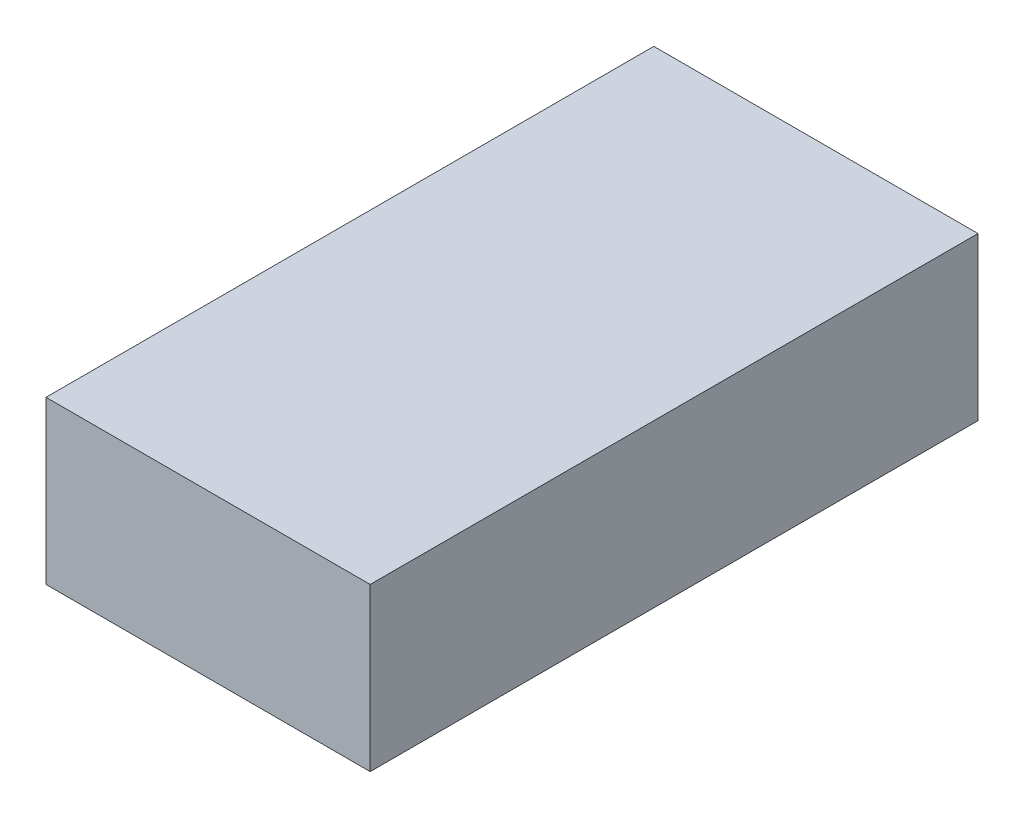
ISO-10303-21;
HEADER;
FILE_DESCRIPTION(('STEP AP214'),'2;1');
FILE_NAME('part.step','',(''),(''),'','','');
FILE_SCHEMA(('AUTOMOTIVE_DESIGN { 1 0 10303 214 1 1 1 1 }'));
ENDSEC;
DATA;
#1=APPLICATION_CONTEXT('core data for automotive mechanical design processes');
#2=APPLICATION_PROTOCOL_DEFINITION('international standard','automotive_design',2000,#1);
#3=PRODUCT_CONTEXT('',#1,'mechanical');
#4=PRODUCT('Part','Part','',(#3));
#5=PRODUCT_RELATED_PRODUCT_CATEGORY('part','',(#4));
#6=PRODUCT_DEFINITION_FORMATION('','',#4);
#7=PRODUCT_DEFINITION_CONTEXT('part definition',#1,'design');
#8=PRODUCT_DEFINITION('design','',#6,#7);
#9=PRODUCT_DEFINITION_SHAPE('','',#8);
#10=(LENGTH_UNIT() NAMED_UNIT(*) SI_UNIT(.MILLI.,.METRE.));
#11=(NAMED_UNIT(*) PLANE_ANGLE_UNIT() SI_UNIT($,.RADIAN.));
#12=(NAMED_UNIT(*) SI_UNIT($,.STERADIAN.) SOLID_ANGLE_UNIT());
#13=UNCERTAINTY_MEASURE_WITH_UNIT(LENGTH_MEASURE(1.E-05),#10,'distance_accuracy_value','');
#14=(GEOMETRIC_REPRESENTATION_CONTEXT(3) GLOBAL_UNCERTAINTY_ASSIGNED_CONTEXT((#13)) GLOBAL_UNIT_ASSIGNED_CONTEXT((#10,
#11,#12)) REPRESENTATION_CONTEXT('',''));
#15=CARTESIAN_POINT('',(0.,0.,0.));
#16=DIRECTION('',(0.,0.,1.));
#17=DIRECTION('',(1.,0.,0.));
#18=AXIS2_PLACEMENT_3D('',#15,#16,#17);
#19=CARTESIAN_POINT('',(18.9,1.62,15.08));
#20=DIRECTION('',(0.,1.,0.));
#21=DIRECTION('',(0.,0.,1.));
#22=AXIS2_PLACEMENT_3D('',#19,#20,#21);
#23=PLANE('',#22);
#24=DIRECTION('',(0.,0.,1.));
#25=VECTOR('',#24,1.);
#26=CARTESIAN_POINT('',(18.5,1.62,14.33));
#27=LINE('',#26,#25);
#28=CARTESIAN_POINT('',(18.5,1.62,14.33));
#29=VERTEX_POINT('',#28);
#30=CARTESIAN_POINT('',(18.5,1.62,15.83));
#31=VERTEX_POINT('',#30);
#32=EDGE_CURVE('E79',#29,#31,#27,.T.);
#33=ORIENTED_EDGE('',*,*,#32,.F.);
#34=DIRECTION('',(-1.,0.,0.));
#35=VECTOR('',#34,1.);
#36=CARTESIAN_POINT('',(19.3,1.62,14.33));
#37=LINE('',#36,#35);
#38=CARTESIAN_POINT('',(19.3,1.62,14.33));
#39=VERTEX_POINT('',#38);
#40=EDGE_CURVE('E55',#39,#29,#37,.T.);
#41=ORIENTED_EDGE('',*,*,#40,.F.);
#42=DIRECTION('',(0.,0.,-1.));
#43=VECTOR('',#42,1.);
#44=CARTESIAN_POINT('',(19.3,1.62,15.83));
#45=LINE('',#44,#43);
#46=CARTESIAN_POINT('',(19.3,1.62,15.83));
#47=VERTEX_POINT('',#46);
#48=EDGE_CURVE('E57',#47,#39,#45,.T.);
#49=ORIENTED_EDGE('',*,*,#48,.F.);
#50=DIRECTION('',(1.,0.,0.));
#51=VECTOR('',#50,1.);
#52=CARTESIAN_POINT('',(18.5,1.62,15.83));
#53=LINE('',#52,#51);
#54=EDGE_CURVE('E20',#31,#47,#53,.T.);
#55=ORIENTED_EDGE('',*,*,#54,.F.);
#56=EDGE_LOOP('',(#33,#41,#49,#55));
#57=FACE_BOUND('',#56,.T.);
#58=ADVANCED_FACE('F17',(#57),#23,.F.);
#59=CARTESIAN_POINT('',(18.5,1.62,15.83));
#60=DIRECTION('',(0.,0.,1.));
#61=DIRECTION('',(1.,0.,0.));
#62=AXIS2_PLACEMENT_3D('',#59,#60,#61);
#63=PLANE('',#62);
#64=DIRECTION('',(1.,0.,0.));
#65=VECTOR('',#64,1.);
#66=CARTESIAN_POINT('',(18.9,2.02,15.83));
#67=LINE('',#66,#65);
#68=CARTESIAN_POINT('',(18.5,2.02,15.83));
#69=VERTEX_POINT('',#68);
#70=CARTESIAN_POINT('',(19.3,2.02,15.83));
#71=VERTEX_POINT('',#70);
#72=EDGE_CURVE('E83',#69,#71,#67,.T.);
#73=ORIENTED_EDGE('',*,*,#72,.F.);
#74=DIRECTION('',(0.,1.,0.));
#75=VECTOR('',#74,1.);
#76=CARTESIAN_POINT('',(18.5,1.62,15.83));
#77=LINE('',#76,#75);
#78=EDGE_CURVE('E68',#31,#69,#77,.T.);
#79=ORIENTED_EDGE('',*,*,#78,.F.);
#80=ORIENTED_EDGE('',*,*,#54,.T.);
#81=DIRECTION('',(0.,1.,0.));
#82=VECTOR('',#81,1.);
#83=CARTESIAN_POINT('',(19.3,1.62,15.83));
#84=LINE('',#83,#82);
#85=EDGE_CURVE('E63',#71,#47,#84,.F.);
#86=ORIENTED_EDGE('',*,*,#85,.F.);
#87=EDGE_LOOP('',(#73,#79,#80,#86));
#88=FACE_BOUND('',#87,.T.);
#89=ADVANCED_FACE('F65',(#88),#63,.T.);
#90=CARTESIAN_POINT('',(19.3,1.62,15.83));
#91=DIRECTION('',(1.,0.,0.));
#92=DIRECTION('',(0.,0.,-1.));
#93=AXIS2_PLACEMENT_3D('',#90,#91,#92);
#94=PLANE('',#93);
#95=DIRECTION('',(0.,0.,1.));
#96=VECTOR('',#95,1.);
#97=CARTESIAN_POINT('',(19.3,2.02,15.08));
#98=LINE('',#97,#96);
#99=CARTESIAN_POINT('',(19.3,2.02,14.33));
#100=VERTEX_POINT('',#99);
#101=EDGE_CURVE('E72',#71,#100,#98,.F.);
#102=ORIENTED_EDGE('',*,*,#101,.F.);
#103=ORIENTED_EDGE('',*,*,#85,.T.);
#104=ORIENTED_EDGE('',*,*,#48,.T.);
#105=DIRECTION('',(0.,1.,0.));
#106=VECTOR('',#105,1.);
#107=CARTESIAN_POINT('',(19.3,1.62,14.33));
#108=LINE('',#107,#106);
#109=EDGE_CURVE('E75',#100,#39,#108,.F.);
#110=ORIENTED_EDGE('',*,*,#109,.F.);
#111=EDGE_LOOP('',(#102,#103,#104,#110));
#112=FACE_BOUND('',#111,.T.);
#113=ADVANCED_FACE('F70',(#112),#94,.T.);
#114=CARTESIAN_POINT('',(19.3,1.62,14.33));
#115=DIRECTION('',(0.,0.,-1.));
#116=DIRECTION('',(-1.,0.,0.));
#117=AXIS2_PLACEMENT_3D('',#114,#115,#116);
#118=PLANE('',#117);
#119=DIRECTION('',(1.,0.,0.));
#120=VECTOR('',#119,1.);
#121=CARTESIAN_POINT('',(18.9,2.02,14.33));
#122=LINE('',#121,#120);
#123=CARTESIAN_POINT('',(18.5,2.02,14.33));
#124=VERTEX_POINT('',#123);
#125=EDGE_CURVE('E26',#100,#124,#122,.F.);
#126=ORIENTED_EDGE('',*,*,#125,.F.);
#127=ORIENTED_EDGE('',*,*,#109,.T.);
#128=ORIENTED_EDGE('',*,*,#40,.T.);
#129=DIRECTION('',(0.,1.,0.));
#130=VECTOR('',#129,1.);
#131=CARTESIAN_POINT('',(18.5,1.62,14.33));
#132=LINE('',#131,#130);
#133=EDGE_CURVE('E35',#124,#29,#132,.F.);
#134=ORIENTED_EDGE('',*,*,#133,.F.);
#135=EDGE_LOOP('',(#126,#127,#128,#134));
#136=FACE_BOUND('',#135,.T.);
#137=ADVANCED_FACE('F89',(#136),#118,.T.);
#138=CARTESIAN_POINT('',(18.5,1.62,14.33));
#139=DIRECTION('',(-1.,0.,0.));
#140=DIRECTION('',(0.,0.,1.));
#141=AXIS2_PLACEMENT_3D('',#138,#139,#140);
#142=PLANE('',#141);
#143=DIRECTION('',(0.,0.,1.));
#144=VECTOR('',#143,1.);
#145=CARTESIAN_POINT('',(18.5,2.02,15.08));
#146=LINE('',#145,#144);
#147=EDGE_CURVE('E11',#124,#69,#146,.T.);
#148=ORIENTED_EDGE('',*,*,#147,.F.);
#149=ORIENTED_EDGE('',*,*,#133,.T.);
#150=ORIENTED_EDGE('',*,*,#32,.T.);
#151=ORIENTED_EDGE('',*,*,#78,.T.);
#152=EDGE_LOOP('',(#148,#149,#150,#151));
#153=FACE_BOUND('',#152,.T.);
#154=ADVANCED_FACE('F91',(#153),#142,.T.);
#155=CARTESIAN_POINT('',(18.9,2.02,15.08));
#156=DIRECTION('',(0.,1.,0.));
#157=DIRECTION('',(0.,0.,1.));
#158=AXIS2_PLACEMENT_3D('',#155,#156,#157);
#159=PLANE('',#158);
#160=ORIENTED_EDGE('',*,*,#125,.T.);
#161=ORIENTED_EDGE('',*,*,#147,.T.);
#162=ORIENTED_EDGE('',*,*,#72,.T.);
#163=ORIENTED_EDGE('',*,*,#101,.T.);
#164=EDGE_LOOP('',(#160,#161,#162,#163));
#165=FACE_BOUND('',#164,.T.);
#166=ADVANCED_FACE('F88',(#165),#159,.T.);
#167=CLOSED_SHELL('',(#58,#89,#113,#137,#154,#166));
#168=MANIFOLD_SOLID_BREP('B1',#167);
#169=ADVANCED_BREP_SHAPE_REPRESENTATION('',(#18,#168),#14);
#170=SHAPE_DEFINITION_REPRESENTATION(#9,#169);
ENDSEC;
END-ISO-10303-21;
